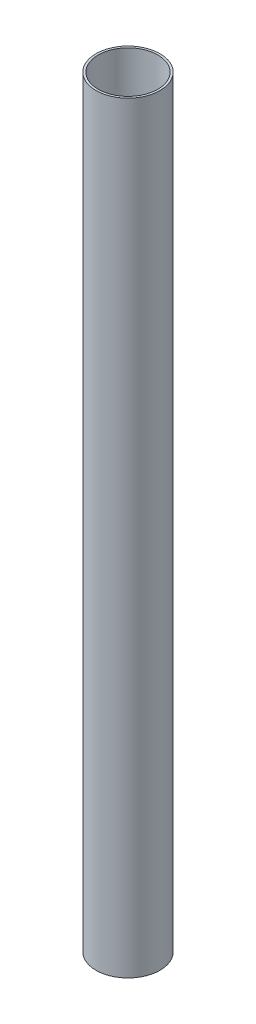
ISO-10303-21;
HEADER;
FILE_DESCRIPTION(('STEP AP214'),'2;1');
FILE_NAME('part.step','',(''),(''),'','','');
FILE_SCHEMA(('AUTOMOTIVE_DESIGN { 1 0 10303 214 1 1 1 1 }'));
ENDSEC;
DATA;
#1=APPLICATION_CONTEXT('core data for automotive mechanical design processes');
#2=APPLICATION_PROTOCOL_DEFINITION('international standard','automotive_design',2000,#1);
#3=PRODUCT_CONTEXT('',#1,'mechanical');
#4=PRODUCT('Part','Part','',(#3));
#5=PRODUCT_RELATED_PRODUCT_CATEGORY('part','',(#4));
#6=PRODUCT_DEFINITION_FORMATION('','',#4);
#7=PRODUCT_DEFINITION_CONTEXT('part definition',#1,'design');
#8=PRODUCT_DEFINITION('design','',#6,#7);
#9=PRODUCT_DEFINITION_SHAPE('','',#8);
#10=(LENGTH_UNIT() NAMED_UNIT(*) SI_UNIT(.MILLI.,.METRE.));
#11=(NAMED_UNIT(*) PLANE_ANGLE_UNIT() SI_UNIT($,.RADIAN.));
#12=(NAMED_UNIT(*) SI_UNIT($,.STERADIAN.) SOLID_ANGLE_UNIT());
#13=UNCERTAINTY_MEASURE_WITH_UNIT(LENGTH_MEASURE(1.E-05),#10,'distance_accuracy_value','');
#14=(GEOMETRIC_REPRESENTATION_CONTEXT(3) GLOBAL_UNCERTAINTY_ASSIGNED_CONTEXT((#13)) GLOBAL_UNIT_ASSIGNED_CONTEXT((#10,
#11,#12)) REPRESENTATION_CONTEXT('',''));
#15=CARTESIAN_POINT('',(0.,0.,0.));
#16=DIRECTION('',(0.,0.,1.));
#17=DIRECTION('',(1.,0.,0.));
#18=AXIS2_PLACEMENT_3D('',#15,#16,#17);
#19=CARTESIAN_POINT('',(0.,700.,0.));
#20=DIRECTION('',(0.,1.,0.));
#21=DIRECTION('',(0.,0.,1.));
#22=AXIS2_PLACEMENT_3D('',#19,#20,#21);
#23=PLANE('',#22);
#24=CARTESIAN_POINT('',(0.,700.,0.));
#25=DIRECTION('',(0.,1.,0.));
#26=DIRECTION('',(0.,0.,1.));
#27=AXIS2_PLACEMENT_3D('',#24,#25,#26);
#28=CIRCLE('',#27,29.3685);
#29=CARTESIAN_POINT('',(0.,700.,29.3685));
#30=VERTEX_POINT('',#29);
#31=EDGE_CURVE('E10',#30,#30,#28,.T.);
#32=ORIENTED_EDGE('',*,*,#31,.T.);
#33=EDGE_LOOP('',(#32));
#34=FACE_BOUND('',#33,.T.);
#35=CARTESIAN_POINT('',(0.,700.,0.));
#36=DIRECTION('',(0.,1.,0.));
#37=DIRECTION('',(0.,0.,1.));
#38=AXIS2_PLACEMENT_3D('',#35,#36,#37);
#39=CIRCLE('',#38,27.3685);
#40=CARTESIAN_POINT('',(0.,700.,27.3685));
#41=VERTEX_POINT('',#40);
#42=EDGE_CURVE('E48',#41,#41,#39,.T.);
#43=ORIENTED_EDGE('',*,*,#42,.F.);
#44=EDGE_LOOP('',(#43));
#45=FACE_BOUND('',#44,.T.);
#46=ADVANCED_FACE('F37',(#34,#45),#23,.T.);
#47=CARTESIAN_POINT('',(0.,0.,0.));
#48=DIRECTION('',(0.,1.,0.));
#49=DIRECTION('',(0.,0.,1.));
#50=AXIS2_PLACEMENT_3D('',#47,#48,#49);
#51=PLANE('',#50);
#52=CARTESIAN_POINT('',(0.,0.,0.));
#53=DIRECTION('',(0.,1.,0.));
#54=DIRECTION('',(0.,0.,1.));
#55=AXIS2_PLACEMENT_3D('',#52,#53,#54);
#56=CIRCLE('',#55,29.3685);
#57=CARTESIAN_POINT('',(0.,0.,29.3685));
#58=VERTEX_POINT('',#57);
#59=EDGE_CURVE('E41',#58,#58,#56,.T.);
#60=ORIENTED_EDGE('',*,*,#59,.F.);
#61=EDGE_LOOP('',(#60));
#62=FACE_BOUND('',#61,.T.);
#63=CARTESIAN_POINT('',(0.,0.,0.));
#64=DIRECTION('',(0.,1.,0.));
#65=DIRECTION('',(0.,0.,1.));
#66=AXIS2_PLACEMENT_3D('',#63,#64,#65);
#67=CIRCLE('',#66,27.3685);
#68=CARTESIAN_POINT('',(0.,0.,27.3685));
#69=VERTEX_POINT('',#68);
#70=EDGE_CURVE('E50',#69,#69,#67,.T.);
#71=ORIENTED_EDGE('',*,*,#70,.T.);
#72=EDGE_LOOP('',(#71));
#73=FACE_BOUND('',#72,.T.);
#74=ADVANCED_FACE('F60',(#62,#73),#51,.F.);
#75=CARTESIAN_POINT('',(0.,700.,0.));
#76=DIRECTION('',(0.,-1.,0.));
#77=DIRECTION('',(0.,0.,-1.));
#78=AXIS2_PLACEMENT_3D('',#75,#76,#77);
#79=CYLINDRICAL_SURFACE('',#78,29.3685);
#80=ORIENTED_EDGE('',*,*,#31,.F.);
#81=EDGE_LOOP('',(#80));
#82=FACE_BOUND('',#81,.T.);
#83=ORIENTED_EDGE('',*,*,#59,.T.);
#84=EDGE_LOOP('',(#83));
#85=FACE_BOUND('',#84,.T.);
#86=ADVANCED_FACE('F39',(#82,#85),#79,.T.);
#87=CARTESIAN_POINT('',(0.,700.,0.));
#88=DIRECTION('',(0.,-1.,0.));
#89=DIRECTION('',(0.,0.,-1.));
#90=AXIS2_PLACEMENT_3D('',#87,#88,#89);
#91=CYLINDRICAL_SURFACE('',#90,27.3685);
#92=ORIENTED_EDGE('',*,*,#42,.T.);
#93=EDGE_LOOP('',(#92));
#94=FACE_BOUND('',#93,.T.);
#95=ORIENTED_EDGE('',*,*,#70,.F.);
#96=EDGE_LOOP('',(#95));
#97=FACE_BOUND('',#96,.T.);
#98=ADVANCED_FACE('F56',(#94,#97),#91,.F.);
#99=CLOSED_SHELL('',(#46,#74,#86,#98));
#100=MANIFOLD_SOLID_BREP('B2',#99);
#101=ADVANCED_BREP_SHAPE_REPRESENTATION('',(#18,#100),#14);
#102=SHAPE_DEFINITION_REPRESENTATION(#9,#101);
ENDSEC;
END-ISO-10303-21;
